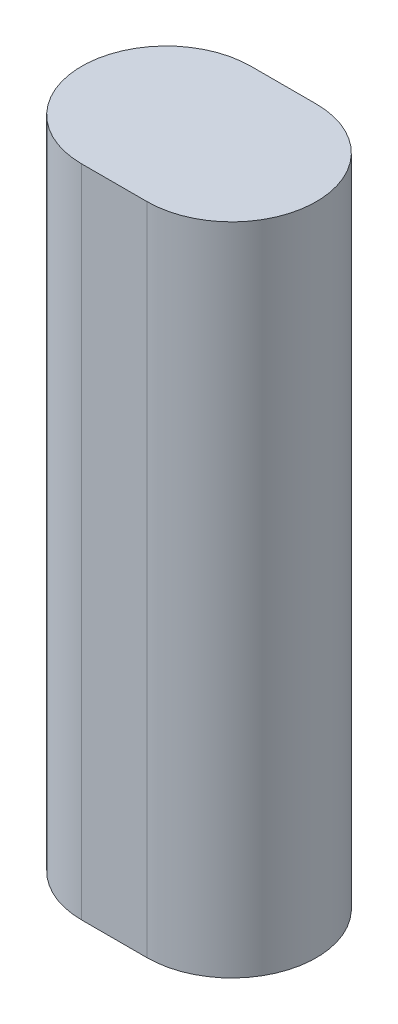
ISO-10303-21;
HEADER;
FILE_DESCRIPTION(('STEP AP214'),'2;1');
FILE_NAME('part.step','',(''),(''),'','','');
FILE_SCHEMA(('AUTOMOTIVE_DESIGN { 1 0 10303 214 1 1 1 1 }'));
ENDSEC;
DATA;
#1=APPLICATION_CONTEXT('core data for automotive mechanical design processes');
#2=APPLICATION_PROTOCOL_DEFINITION('international standard','automotive_design',2000,#1);
#3=PRODUCT_CONTEXT('',#1,'mechanical');
#4=PRODUCT('Part','Part','',(#3));
#5=PRODUCT_RELATED_PRODUCT_CATEGORY('part','',(#4));
#6=PRODUCT_DEFINITION_FORMATION('','',#4);
#7=PRODUCT_DEFINITION_CONTEXT('part definition',#1,'design');
#8=PRODUCT_DEFINITION('design','',#6,#7);
#9=PRODUCT_DEFINITION_SHAPE('','',#8);
#10=(LENGTH_UNIT() NAMED_UNIT(*) SI_UNIT(.MILLI.,.METRE.));
#11=(NAMED_UNIT(*) PLANE_ANGLE_UNIT() SI_UNIT($,.RADIAN.));
#12=(NAMED_UNIT(*) SI_UNIT($,.STERADIAN.) SOLID_ANGLE_UNIT());
#13=UNCERTAINTY_MEASURE_WITH_UNIT(LENGTH_MEASURE(1.E-05),#10,'distance_accuracy_value','');
#14=(GEOMETRIC_REPRESENTATION_CONTEXT(3) GLOBAL_UNCERTAINTY_ASSIGNED_CONTEXT((#13)) GLOBAL_UNIT_ASSIGNED_CONTEXT((#10,
#11,#12)) REPRESENTATION_CONTEXT('',''));
#15=CARTESIAN_POINT('',(0.,0.,0.));
#16=DIRECTION('',(0.,0.,1.));
#17=DIRECTION('',(1.,0.,0.));
#18=AXIS2_PLACEMENT_3D('',#15,#16,#17);
#19=CARTESIAN_POINT('',(0.,120.,15.5));
#20=DIRECTION('',(0.,0.,-1.));
#21=DIRECTION('',(-1.,0.,0.));
#22=AXIS2_PLACEMENT_3D('',#19,#20,#21);
#23=PLANE('',#22);
#24=DIRECTION('',(1.,0.,0.));
#25=VECTOR('',#24,1.);
#26=CARTESIAN_POINT('',(0.,0.,15.5));
#27=LINE('',#26,#25);
#28=CARTESIAN_POINT('',(0.,0.,15.5));
#29=VERTEX_POINT('',#28);
#30=CARTESIAN_POINT('',(12.,0.,15.5));
#31=VERTEX_POINT('',#30);
#32=EDGE_CURVE('E94',#29,#31,#27,.T.);
#33=ORIENTED_EDGE('',*,*,#32,.T.);
#34=DIRECTION('',(0.,-1.,0.));
#35=VECTOR('',#34,1.);
#36=CARTESIAN_POINT('',(12.,120.,15.5));
#37=LINE('',#36,#35);
#38=CARTESIAN_POINT('',(12.,120.,15.5));
#39=VERTEX_POINT('',#38);
#40=EDGE_CURVE('E11',#39,#31,#37,.T.);
#41=ORIENTED_EDGE('',*,*,#40,.F.);
#42=DIRECTION('',(1.,0.,0.));
#43=VECTOR('',#42,1.);
#44=CARTESIAN_POINT('',(0.,120.,15.5));
#45=LINE('',#44,#43);
#46=CARTESIAN_POINT('',(0.,120.,15.5));
#47=VERTEX_POINT('',#46);
#48=EDGE_CURVE('E79',#47,#39,#45,.T.);
#49=ORIENTED_EDGE('',*,*,#48,.F.);
#50=DIRECTION('',(0.,-1.,0.));
#51=VECTOR('',#50,1.);
#52=CARTESIAN_POINT('',(0.,120.,15.5));
#53=LINE('',#52,#51);
#54=EDGE_CURVE('E90',#47,#29,#53,.T.);
#55=ORIENTED_EDGE('',*,*,#54,.T.);
#56=EDGE_LOOP('',(#33,#41,#49,#55));
#57=FACE_BOUND('',#56,.T.);
#58=ADVANCED_FACE('F32',(#57),#23,.F.);
#59=CARTESIAN_POINT('',(12.,120.,0.));
#60=DIRECTION('',(0.,-1.,0.));
#61=DIRECTION('',(0.,0.,-1.));
#62=AXIS2_PLACEMENT_3D('',#59,#60,#61);
#63=CYLINDRICAL_SURFACE('',#62,15.5);
#64=CARTESIAN_POINT('',(12.,0.,0.));
#65=DIRECTION('',(0.,1.,0.));
#66=DIRECTION('',(0.,0.,1.));
#67=AXIS2_PLACEMENT_3D('',#64,#65,#66);
#68=CIRCLE('',#67,15.5);
#69=CARTESIAN_POINT('',(12.,0.,-15.5));
#70=VERTEX_POINT('',#69);
#71=EDGE_CURVE('E84',#31,#70,#68,.T.);
#72=ORIENTED_EDGE('',*,*,#71,.T.);
#73=DIRECTION('',(0.,-1.,0.));
#74=VECTOR('',#73,1.);
#75=CARTESIAN_POINT('',(12.,120.,-15.5));
#76=LINE('',#75,#74);
#77=CARTESIAN_POINT('',(12.,120.,-15.5));
#78=VERTEX_POINT('',#77);
#79=EDGE_CURVE('E40',#78,#70,#76,.T.);
#80=ORIENTED_EDGE('',*,*,#79,.F.);
#81=CARTESIAN_POINT('',(12.,120.,0.));
#82=DIRECTION('',(0.,1.,0.));
#83=DIRECTION('',(0.,0.,1.));
#84=AXIS2_PLACEMENT_3D('',#81,#82,#83);
#85=CIRCLE('',#84,15.5);
#86=EDGE_CURVE('E74',#39,#78,#85,.T.);
#87=ORIENTED_EDGE('',*,*,#86,.F.);
#88=ORIENTED_EDGE('',*,*,#40,.T.);
#89=EDGE_LOOP('',(#72,#80,#87,#88));
#90=FACE_BOUND('',#89,.T.);
#91=ADVANCED_FACE('F83',(#90),#63,.T.);
#92=CARTESIAN_POINT('',(0.,120.,-15.5));
#93=DIRECTION('',(0.,0.,-1.));
#94=DIRECTION('',(-1.,0.,0.));
#95=AXIS2_PLACEMENT_3D('',#92,#93,#94);
#96=PLANE('',#95);
#97=DIRECTION('',(1.,0.,0.));
#98=VECTOR('',#97,1.);
#99=CARTESIAN_POINT('',(0.,0.,-15.5));
#100=LINE('',#99,#98);
#101=CARTESIAN_POINT('',(0.,0.,-15.5));
#102=VERTEX_POINT('',#101);
#103=EDGE_CURVE('E98',#102,#70,#100,.T.);
#104=ORIENTED_EDGE('',*,*,#103,.F.);
#105=DIRECTION('',(0.,-1.,0.));
#106=VECTOR('',#105,1.);
#107=CARTESIAN_POINT('',(0.,120.,-15.5));
#108=LINE('',#107,#106);
#109=CARTESIAN_POINT('',(0.,120.,-15.5));
#110=VERTEX_POINT('',#109);
#111=EDGE_CURVE('E64',#110,#102,#108,.T.);
#112=ORIENTED_EDGE('',*,*,#111,.F.);
#113=DIRECTION('',(1.,0.,0.));
#114=VECTOR('',#113,1.);
#115=CARTESIAN_POINT('',(0.,120.,-15.5));
#116=LINE('',#115,#114);
#117=EDGE_CURVE('E77',#110,#78,#116,.T.);
#118=ORIENTED_EDGE('',*,*,#117,.T.);
#119=ORIENTED_EDGE('',*,*,#79,.T.);
#120=EDGE_LOOP('',(#104,#112,#118,#119));
#121=FACE_BOUND('',#120,.T.);
#122=ADVANCED_FACE('F88',(#121),#96,.T.);
#123=CARTESIAN_POINT('',(0.,120.,0.));
#124=DIRECTION('',(0.,-1.,0.));
#125=DIRECTION('',(0.,0.,-1.));
#126=AXIS2_PLACEMENT_3D('',#123,#124,#125);
#127=CYLINDRICAL_SURFACE('',#126,15.5);
#128=CARTESIAN_POINT('',(0.,0.,0.));
#129=DIRECTION('',(0.,1.,0.));
#130=DIRECTION('',(0.,0.,1.));
#131=AXIS2_PLACEMENT_3D('',#128,#129,#130);
#132=CIRCLE('',#131,15.5);
#133=EDGE_CURVE('E67',#102,#29,#132,.T.);
#134=ORIENTED_EDGE('',*,*,#133,.T.);
#135=ORIENTED_EDGE('',*,*,#54,.F.);
#136=CARTESIAN_POINT('',(0.,120.,0.));
#137=DIRECTION('',(0.,1.,0.));
#138=DIRECTION('',(0.,0.,1.));
#139=AXIS2_PLACEMENT_3D('',#136,#137,#138);
#140=CIRCLE('',#139,15.5);
#141=EDGE_CURVE('E48',#110,#47,#140,.T.);
#142=ORIENTED_EDGE('',*,*,#141,.F.);
#143=ORIENTED_EDGE('',*,*,#111,.T.);
#144=EDGE_LOOP('',(#134,#135,#142,#143));
#145=FACE_BOUND('',#144,.T.);
#146=ADVANCED_FACE('F111',(#145),#127,.T.);
#147=CARTESIAN_POINT('',(12.,120.,0.));
#148=DIRECTION('',(0.,1.,0.));
#149=DIRECTION('',(0.,0.,1.));
#150=AXIS2_PLACEMENT_3D('',#147,#148,#149);
#151=PLANE('',#150);
#152=ORIENTED_EDGE('',*,*,#48,.T.);
#153=ORIENTED_EDGE('',*,*,#86,.T.);
#154=ORIENTED_EDGE('',*,*,#117,.F.);
#155=ORIENTED_EDGE('',*,*,#141,.T.);
#156=EDGE_LOOP('',(#152,#153,#154,#155));
#157=FACE_BOUND('',#156,.T.);
#158=ADVANCED_FACE('F75',(#157),#151,.T.);
#159=CARTESIAN_POINT('',(12.,0.,0.));
#160=DIRECTION('',(0.,1.,0.));
#161=DIRECTION('',(0.,0.,1.));
#162=AXIS2_PLACEMENT_3D('',#159,#160,#161);
#163=PLANE('',#162);
#164=ORIENTED_EDGE('',*,*,#32,.F.);
#165=ORIENTED_EDGE('',*,*,#133,.F.);
#166=ORIENTED_EDGE('',*,*,#103,.T.);
#167=ORIENTED_EDGE('',*,*,#71,.F.);
#168=EDGE_LOOP('',(#164,#165,#166,#167));
#169=FACE_BOUND('',#168,.T.);
#170=ADVANCED_FACE('F105',(#169),#163,.F.);
#171=CLOSED_SHELL('',(#58,#91,#122,#146,#158,#170));
#172=MANIFOLD_SOLID_BREP('B2',#171);
#173=ADVANCED_BREP_SHAPE_REPRESENTATION('',(#18,#172),#14);
#174=SHAPE_DEFINITION_REPRESENTATION(#9,#173);
ENDSEC;
END-ISO-10303-21;
